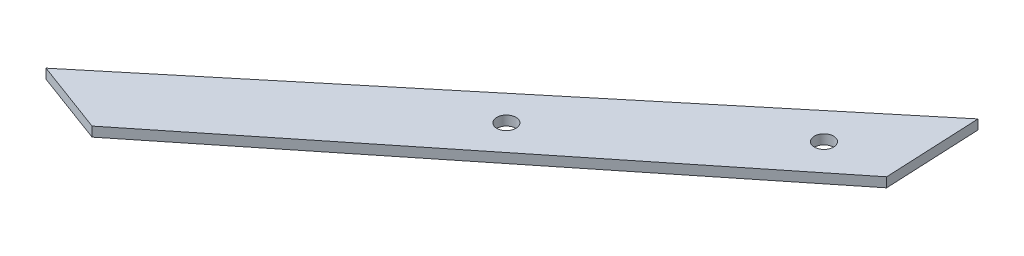
ISO-10303-21;
HEADER;
FILE_DESCRIPTION(('STEP AP214'),'2;1');
FILE_NAME('part.step','',(''),(''),'','','');
FILE_SCHEMA(('AUTOMOTIVE_DESIGN { 1 0 10303 214 1 1 1 1 }'));
ENDSEC;
DATA;
#1=APPLICATION_CONTEXT('core data for automotive mechanical design processes');
#2=APPLICATION_PROTOCOL_DEFINITION('international standard','automotive_design',2000,#1);
#3=PRODUCT_CONTEXT('',#1,'mechanical');
#4=PRODUCT('Part','Part','',(#3));
#5=PRODUCT_RELATED_PRODUCT_CATEGORY('part','',(#4));
#6=PRODUCT_DEFINITION_FORMATION('','',#4);
#7=PRODUCT_DEFINITION_CONTEXT('part definition',#1,'design');
#8=PRODUCT_DEFINITION('design','',#6,#7);
#9=PRODUCT_DEFINITION_SHAPE('','',#8);
#10=(LENGTH_UNIT() NAMED_UNIT(*) SI_UNIT(.MILLI.,.METRE.));
#11=(NAMED_UNIT(*) PLANE_ANGLE_UNIT() SI_UNIT($,.RADIAN.));
#12=(NAMED_UNIT(*) SI_UNIT($,.STERADIAN.) SOLID_ANGLE_UNIT());
#13=UNCERTAINTY_MEASURE_WITH_UNIT(LENGTH_MEASURE(1.E-05),#10,'distance_accuracy_value','');
#14=(GEOMETRIC_REPRESENTATION_CONTEXT(3) GLOBAL_UNCERTAINTY_ASSIGNED_CONTEXT((#13)) GLOBAL_UNIT_ASSIGNED_CONTEXT((#10,
#11,#12)) REPRESENTATION_CONTEXT('',''));
#15=CARTESIAN_POINT('',(0.,0.,0.));
#16=DIRECTION('',(0.,0.,1.));
#17=DIRECTION('',(1.,0.,0.));
#18=AXIS2_PLACEMENT_3D('',#15,#16,#17);
#19=CARTESIAN_POINT('',(0.,1.,0.));
#20=DIRECTION('',(-0.998930077389047,0.,0.0462460861858926));
#21=DIRECTION('',(0.0462460861858926,0.,0.998930077389047));
#22=AXIS2_PLACEMENT_3D('',#19,#20,#21);
#23=PLANE('',#22);
#24=DIRECTION('',(-0.0462460861858926,0.,-0.998930077389047));
#25=VECTOR('',#24,1.);
#26=CARTESIAN_POINT('',(0.,1.,0.));
#27=LINE('',#26,#25);
#28=CARTESIAN_POINT('',(-2.54284683022946,1.,-54.926295183104));
#29=VERTEX_POINT('',#28);
#30=CARTESIAN_POINT('',(-3.00599560208302,1.,-64.930455030288));
#31=VERTEX_POINT('',#30);
#32=EDGE_CURVE('E80',#29,#31,#27,.T.);
#33=ORIENTED_EDGE('',*,*,#32,.F.);
#34=DIRECTION('',(0.,1.,0.));
#35=VECTOR('',#34,1.);
#36=CARTESIAN_POINT('',(-2.54284683022946,-9.,-54.926295183104));
#37=LINE('',#36,#35);
#38=CARTESIAN_POINT('',(-2.54284683022946,0.,-54.926295183104));
#39=VERTEX_POINT('',#38);
#40=EDGE_CURVE('E41',#39,#29,#37,.T.);
#41=ORIENTED_EDGE('',*,*,#40,.F.);
#42=DIRECTION('',(-0.0462460861858926,0.,-0.998930077389047));
#43=VECTOR('',#42,1.);
#44=CARTESIAN_POINT('',(0.,0.,0.));
#45=LINE('',#44,#43);
#46=CARTESIAN_POINT('',(-3.00599560208302,0.,-64.930455030288));
#47=VERTEX_POINT('',#46);
#48=EDGE_CURVE('E76',#39,#47,#45,.T.);
#49=ORIENTED_EDGE('',*,*,#48,.T.);
#50=DIRECTION('',(0.,-1.,0.));
#51=VECTOR('',#50,1.);
#52=CARTESIAN_POINT('',(-3.00599560208302,1.,-64.930455030288));
#53=LINE('',#52,#51);
#54=EDGE_CURVE('E88',#31,#47,#53,.T.);
#55=ORIENTED_EDGE('',*,*,#54,.F.);
#56=EDGE_LOOP('',(#33,#41,#49,#55));
#57=FACE_BOUND('',#56,.T.);
#58=ADVANCED_FACE('F32',(#57),#23,.F.);
#59=CARTESIAN_POINT('',(0.,1.,0.));
#60=DIRECTION('',(0.347743329632803,0.,-0.937589769939867));
#61=DIRECTION('',(-0.937589769939867,0.,-0.347743329632803));
#62=AXIS2_PLACEMENT_3D('',#59,#60,#61);
#63=PLANE('',#62);
#64=DIRECTION('',(0.937589769939866,0.,0.347743329632803));
#65=VECTOR('',#64,1.);
#66=CARTESIAN_POINT('',(0.,0.,0.));
#67=LINE('',#66,#65);
#68=CARTESIAN_POINT('',(-56.255386196392,0.,-20.8645997779682));
#69=VERTEX_POINT('',#68);
#70=CARTESIAN_POINT('',(-48.6156378822954,0.,-18.0310881490274));
#71=VERTEX_POINT('',#70);
#72=EDGE_CURVE('E100',#69,#71,#67,.T.);
#73=ORIENTED_EDGE('',*,*,#72,.T.);
#74=DIRECTION('',(0.,1.,0.));
#75=VECTOR('',#74,1.);
#76=CARTESIAN_POINT('',(-48.6156378822954,-9.,-18.0310881490274));
#77=LINE('',#76,#75);
#78=CARTESIAN_POINT('',(-48.6156378822954,1.,-18.0310881490274));
#79=VERTEX_POINT('',#78);
#80=EDGE_CURVE('E98',#71,#79,#77,.T.);
#81=ORIENTED_EDGE('',*,*,#80,.T.);
#82=DIRECTION('',(0.937589769939866,0.,0.347743329632803));
#83=VECTOR('',#82,1.);
#84=CARTESIAN_POINT('',(0.,1.,0.));
#85=LINE('',#84,#83);
#86=CARTESIAN_POINT('',(-56.255386196392,1.,-20.8645997779682));
#87=VERTEX_POINT('',#86);
#88=EDGE_CURVE('E90',#87,#79,#85,.T.);
#89=ORIENTED_EDGE('',*,*,#88,.F.);
#90=DIRECTION('',(0.,-1.,0.));
#91=VECTOR('',#90,1.);
#92=CARTESIAN_POINT('',(-56.255386196392,1.,-20.8645997779682));
#93=LINE('',#92,#91);
#94=EDGE_CURVE('E85',#87,#69,#93,.T.);
#95=ORIENTED_EDGE('',*,*,#94,.T.);
#96=EDGE_LOOP('',(#73,#81,#89,#95));
#97=FACE_BOUND('',#96,.T.);
#98=ADVANCED_FACE('F125',(#97),#63,.F.);
#99=CARTESIAN_POINT('',(0.,1.,0.));
#100=DIRECTION('',(0.,1.,0.));
#101=DIRECTION('',(0.,0.,1.));
#102=AXIS2_PLACEMENT_3D('',#99,#100,#101);
#103=PLANE('',#102);
#104=CARTESIAN_POINT('',(-8.99313398700904,1.,-54.8352861955758));
#105=DIRECTION('',(0.,1.,0.));
#106=DIRECTION('',(0.,0.,1.));
#107=AXIS2_PLACEMENT_3D('',#104,#105,#106);
#108=CIRCLE('',#107,1.);
#109=CARTESIAN_POINT('',(-8.99313398700904,1.,-53.8352861955758));
#110=VERTEX_POINT('',#109);
#111=EDGE_CURVE('E114',#110,#110,#108,.T.);
#112=ORIENTED_EDGE('',*,*,#111,.F.);
#113=EDGE_LOOP('',(#112));
#114=FACE_BOUND('',#113,.T.);
#115=CARTESIAN_POINT('',(-27.2732839858833,1.,-39.9537218295084));
#116=DIRECTION('',(0.,1.,0.));
#117=DIRECTION('',(0.,0.,1.));
#118=AXIS2_PLACEMENT_3D('',#115,#116,#117);
#119=CIRCLE('',#118,1.);
#120=CARTESIAN_POINT('',(-27.2732839858833,1.,-38.9537218295084));
#121=VERTEX_POINT('',#120);
#122=EDGE_CURVE('E107',#121,#121,#119,.T.);
#123=ORIENTED_EDGE('',*,*,#122,.F.);
#124=EDGE_LOOP('',(#123));
#125=FACE_BOUND('',#124,.T.);
#126=DIRECTION('',(-0.780563147683892,0.,0.625076933247272));
#127=VECTOR('',#126,1.);
#128=CARTESIAN_POINT('',(-48.6156378822954,1.,-18.0310881490274));
#129=LINE('',#128,#127);
#130=EDGE_CURVE('E11',#29,#79,#129,.T.);
#131=ORIENTED_EDGE('',*,*,#130,.F.);
#132=ORIENTED_EDGE('',*,*,#32,.T.);
#133=DIRECTION('',(-0.770412839515563,0.,0.637545336983628));
#134=VECTOR('',#133,1.);
#135=CARTESIAN_POINT('',(-56.255386196392,1.,-20.8645997779682));
#136=LINE('',#135,#134);
#137=EDGE_CURVE('E84',#31,#87,#136,.T.);
#138=ORIENTED_EDGE('',*,*,#137,.T.);
#139=ORIENTED_EDGE('',*,*,#88,.T.);
#140=EDGE_LOOP('',(#131,#132,#138,#139));
#141=FACE_BOUND('',#140,.T.);
#142=ADVANCED_FACE('F82',(#114,#125,#141),#103,.T.);
#143=CARTESIAN_POINT('',(0.,0.,0.));
#144=DIRECTION('',(0.,1.,0.));
#145=DIRECTION('',(0.,0.,1.));
#146=AXIS2_PLACEMENT_3D('',#143,#144,#145);
#147=PLANE('',#146);
#148=CARTESIAN_POINT('',(-8.99313398700904,0.,-54.8352861955758));
#149=DIRECTION('',(0.,1.,0.));
#150=DIRECTION('',(0.,0.,1.));
#151=AXIS2_PLACEMENT_3D('',#148,#149,#150);
#152=CIRCLE('',#151,1.);
#153=CARTESIAN_POINT('',(-8.99313398700904,0.,-53.8352861955758));
#154=VERTEX_POINT('',#153);
#155=EDGE_CURVE('E35',#154,#154,#152,.T.);
#156=ORIENTED_EDGE('',*,*,#155,.T.);
#157=EDGE_LOOP('',(#156));
#158=FACE_BOUND('',#157,.T.);
#159=CARTESIAN_POINT('',(-27.2732839858833,0.,-39.9537218295084));
#160=DIRECTION('',(0.,1.,0.));
#161=DIRECTION('',(0.,0.,1.));
#162=AXIS2_PLACEMENT_3D('',#159,#160,#161);
#163=CIRCLE('',#162,1.);
#164=CARTESIAN_POINT('',(-27.2732839858833,0.,-38.9537218295084));
#165=VERTEX_POINT('',#164);
#166=EDGE_CURVE('E105',#165,#165,#163,.T.);
#167=ORIENTED_EDGE('',*,*,#166,.T.);
#168=EDGE_LOOP('',(#167));
#169=FACE_BOUND('',#168,.T.);
#170=ORIENTED_EDGE('',*,*,#48,.F.);
#171=DIRECTION('',(-0.780563147683892,0.,0.625076933247272));
#172=VECTOR('',#171,1.);
#173=CARTESIAN_POINT('',(-27.7927436497541,0.,-34.7061142591255));
#174=LINE('',#173,#172);
#175=EDGE_CURVE('E50',#39,#71,#174,.T.);
#176=ORIENTED_EDGE('',*,*,#175,.T.);
#177=ORIENTED_EDGE('',*,*,#72,.F.);
#178=DIRECTION('',(-0.770412839515563,0.,0.637545336983628));
#179=VECTOR('',#178,1.);
#180=CARTESIAN_POINT('',(-56.255386196392,0.,-20.8645997779682));
#181=LINE('',#180,#179);
#182=EDGE_CURVE('E67',#47,#69,#181,.T.);
#183=ORIENTED_EDGE('',*,*,#182,.F.);
#184=EDGE_LOOP('',(#170,#176,#177,#183));
#185=FACE_BOUND('',#184,.T.);
#186=ADVANCED_FACE('F124',(#158,#169,#185),#147,.F.);
#187=CARTESIAN_POINT('',(-56.255386196392,1.,-20.8645997779682));
#188=DIRECTION('',(0.637545336983628,0.,0.770412839515563));
#189=DIRECTION('',(0.770412839515563,0.,-0.637545336983628));
#190=AXIS2_PLACEMENT_3D('',#187,#188,#189);
#191=PLANE('',#190);
#192=ORIENTED_EDGE('',*,*,#182,.T.);
#193=ORIENTED_EDGE('',*,*,#94,.F.);
#194=ORIENTED_EDGE('',*,*,#137,.F.);
#195=ORIENTED_EDGE('',*,*,#54,.T.);
#196=EDGE_LOOP('',(#192,#193,#194,#195));
#197=FACE_BOUND('',#196,.T.);
#198=ADVANCED_FACE('F87',(#197),#191,.F.);
#199=CARTESIAN_POINT('',(-48.6156378822954,-9.,-18.0310881490274));
#200=DIRECTION('',(-0.625076933247272,0.,-0.780563147683892));
#201=DIRECTION('',(-0.780563147683892,0.,0.625076933247272));
#202=AXIS2_PLACEMENT_3D('',#199,#200,#201);
#203=PLANE('',#202);
#204=ORIENTED_EDGE('',*,*,#40,.T.);
#205=ORIENTED_EDGE('',*,*,#130,.T.);
#206=ORIENTED_EDGE('',*,*,#80,.F.);
#207=ORIENTED_EDGE('',*,*,#175,.F.);
#208=EDGE_LOOP('',(#204,#205,#206,#207));
#209=FACE_BOUND('',#208,.T.);
#210=ADVANCED_FACE('F150',(#209),#203,.F.);
#211=CARTESIAN_POINT('',(-27.2732839858833,-9.,-39.9537218295084));
#212=DIRECTION('',(0.,1.,0.));
#213=DIRECTION('',(0.,0.,1.));
#214=AXIS2_PLACEMENT_3D('',#211,#212,#213);
#215=CYLINDRICAL_SURFACE('',#214,1.);
#216=ORIENTED_EDGE('',*,*,#122,.T.);
#217=EDGE_LOOP('',(#216));
#218=FACE_BOUND('',#217,.T.);
#219=ORIENTED_EDGE('',*,*,#166,.F.);
#220=EDGE_LOOP('',(#219));
#221=FACE_BOUND('',#220,.T.);
#222=ADVANCED_FACE('F158',(#218,#221),#215,.F.);
#223=CARTESIAN_POINT('',(-8.99313398700904,-7.,-54.8352861955758));
#224=DIRECTION('',(0.,1.,0.));
#225=DIRECTION('',(0.,0.,1.));
#226=AXIS2_PLACEMENT_3D('',#223,#224,#225);
#227=CYLINDRICAL_SURFACE('',#226,1.);
#228=ORIENTED_EDGE('',*,*,#111,.T.);
#229=EDGE_LOOP('',(#228));
#230=FACE_BOUND('',#229,.T.);
#231=ORIENTED_EDGE('',*,*,#155,.F.);
#232=EDGE_LOOP('',(#231));
#233=FACE_BOUND('',#232,.T.);
#234=ADVANCED_FACE('F119',(#230,#233),#227,.F.);
#235=CLOSED_SHELL('',(#58,#98,#142,#186,#198,#210,#222,#234));
#236=MANIFOLD_SOLID_BREP('B2',#235);
#237=ADVANCED_BREP_SHAPE_REPRESENTATION('',(#18,#236),#14);
#238=SHAPE_DEFINITION_REPRESENTATION(#9,#237);
ENDSEC;
END-ISO-10303-21;
